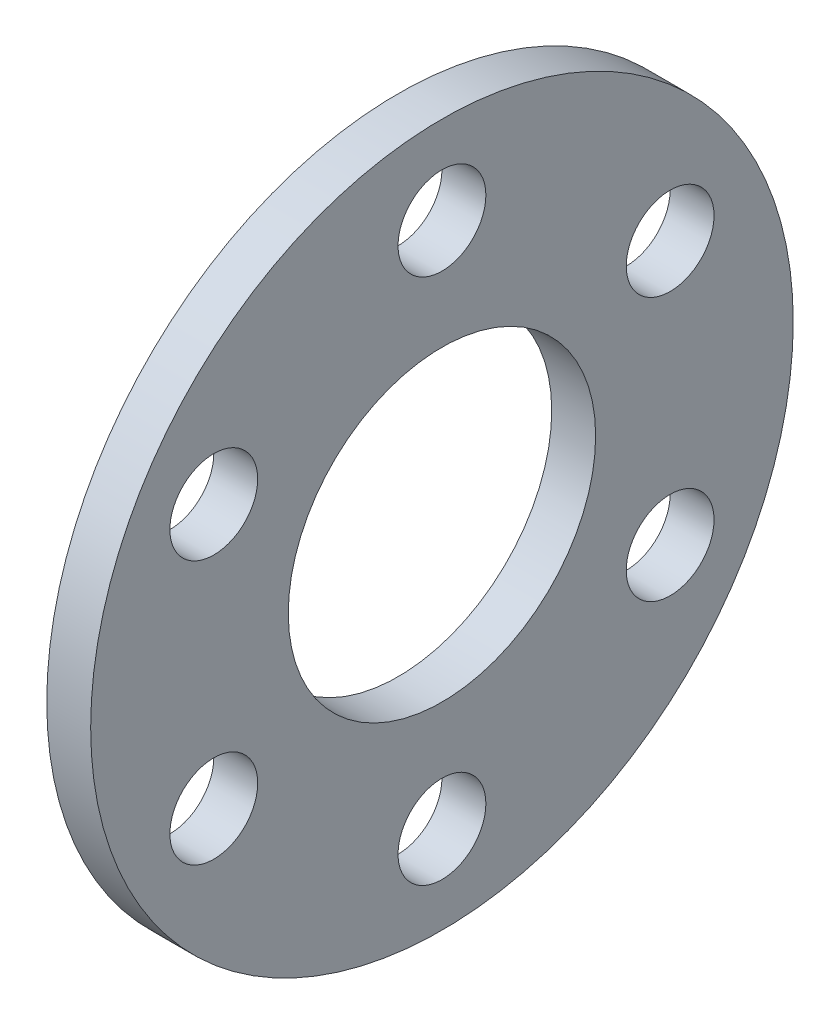
ISO-10303-21;
HEADER;
FILE_DESCRIPTION(('STEP AP214'),'2;1');
FILE_NAME('part.step','',(''),(''),'','','');
FILE_SCHEMA(('AUTOMOTIVE_DESIGN { 1 0 10303 214 1 1 1 1 }'));
ENDSEC;
DATA;
#1=APPLICATION_CONTEXT('core data for automotive mechanical design processes');
#2=APPLICATION_PROTOCOL_DEFINITION('international standard','automotive_design',2000,#1);
#3=PRODUCT_CONTEXT('',#1,'mechanical');
#4=PRODUCT('Part','Part','',(#3));
#5=PRODUCT_RELATED_PRODUCT_CATEGORY('part','',(#4));
#6=PRODUCT_DEFINITION_FORMATION('','',#4);
#7=PRODUCT_DEFINITION_CONTEXT('part definition',#1,'design');
#8=PRODUCT_DEFINITION('design','',#6,#7);
#9=PRODUCT_DEFINITION_SHAPE('','',#8);
#10=(LENGTH_UNIT() NAMED_UNIT(*) SI_UNIT(.MILLI.,.METRE.));
#11=(NAMED_UNIT(*) PLANE_ANGLE_UNIT() SI_UNIT($,.RADIAN.));
#12=(NAMED_UNIT(*) SI_UNIT($,.STERADIAN.) SOLID_ANGLE_UNIT());
#13=UNCERTAINTY_MEASURE_WITH_UNIT(LENGTH_MEASURE(1.E-05),#10,'distance_accuracy_value','');
#14=(GEOMETRIC_REPRESENTATION_CONTEXT(3) GLOBAL_UNCERTAINTY_ASSIGNED_CONTEXT((#13)) GLOBAL_UNIT_ASSIGNED_CONTEXT((#10,
#11,#12)) REPRESENTATION_CONTEXT('',''));
#15=CARTESIAN_POINT('',(0.,0.,0.));
#16=DIRECTION('',(0.,0.,1.));
#17=DIRECTION('',(1.,0.,0.));
#18=AXIS2_PLACEMENT_3D('',#15,#16,#17);
#19=CARTESIAN_POINT('',(3.,0.,0.));
#20=DIRECTION('',(1.,0.,0.));
#21=DIRECTION('',(0.,0.,-1.));
#22=AXIS2_PLACEMENT_3D('',#19,#20,#21);
#23=PLANE('',#22);
#24=CARTESIAN_POINT('',(3.,-17.9999999999996,-8.17298183197627E-13));
#25=DIRECTION('',(1.,0.,0.));
#26=DIRECTION('',(0.,0.,-1.));
#27=AXIS2_PLACEMENT_3D('',#24,#25,#26);
#28=CIRCLE('',#27,3.);
#29=CARTESIAN_POINT('',(3.,-17.9999999999996,-3.00000000000082));
#30=VERTEX_POINT('',#29);
#31=EDGE_CURVE('E72',#30,#30,#28,.T.);
#32=ORIENTED_EDGE('',*,*,#31,.F.);
#33=EDGE_LOOP('',(#32));
#34=FACE_BOUND('',#33,.T.);
#35=CARTESIAN_POINT('',(3.,9.00000000000092,-15.5884572681199));
#36=DIRECTION('',(1.,0.,0.));
#37=DIRECTION('',(0.,0.,-1.));
#38=AXIS2_PLACEMENT_3D('',#35,#36,#37);
#39=CIRCLE('',#38,3.);
#40=CARTESIAN_POINT('',(3.,9.00000000000092,-18.5884572681199));
#41=VERTEX_POINT('',#40);
#42=EDGE_CURVE('E60',#41,#41,#39,.T.);
#43=ORIENTED_EDGE('',*,*,#42,.F.);
#44=EDGE_LOOP('',(#43));
#45=FACE_BOUND('',#44,.T.);
#46=CARTESIAN_POINT('',(3.,8.99999999999996,15.5884572681199));
#47=DIRECTION('',(1.,0.,0.));
#48=DIRECTION('',(0.,0.,-1.));
#49=AXIS2_PLACEMENT_3D('',#46,#47,#48);
#50=CIRCLE('',#49,3.);
#51=CARTESIAN_POINT('',(3.,8.99999999999996,12.5884572681199));
#52=VERTEX_POINT('',#51);
#53=EDGE_CURVE('E48',#52,#52,#50,.T.);
#54=ORIENTED_EDGE('',*,*,#53,.F.);
#55=EDGE_LOOP('',(#54));
#56=FACE_BOUND('',#55,.T.);
#57=CARTESIAN_POINT('',(3.,0.,0.));
#58=DIRECTION('',(1.,0.,0.));
#59=DIRECTION('',(0.,0.,-1.));
#60=AXIS2_PLACEMENT_3D('',#57,#58,#59);
#61=CIRCLE('',#60,24.);
#62=CARTESIAN_POINT('',(3.,0.,-24.));
#63=VERTEX_POINT('',#62);
#64=EDGE_CURVE('E10',#63,#63,#61,.T.);
#65=ORIENTED_EDGE('',*,*,#64,.T.);
#66=EDGE_LOOP('',(#65));
#67=FACE_BOUND('',#66,.T.);
#68=CARTESIAN_POINT('',(3.,0.,0.));
#69=DIRECTION('',(1.,0.,0.));
#70=DIRECTION('',(0.,0.,-1.));
#71=AXIS2_PLACEMENT_3D('',#68,#69,#70);
#72=CIRCLE('',#71,10.5);
#73=CARTESIAN_POINT('',(3.,0.,-10.5));
#74=VERTEX_POINT('',#73);
#75=EDGE_CURVE('E43',#74,#74,#72,.T.);
#76=ORIENTED_EDGE('',*,*,#75,.F.);
#77=EDGE_LOOP('',(#76));
#78=FACE_BOUND('',#77,.T.);
#79=CARTESIAN_POINT('',(3.,18.0000000000004,3.00753131340047E-13));
#80=DIRECTION('',(1.,0.,0.));
#81=DIRECTION('',(0.,0.,-1.));
#82=AXIS2_PLACEMENT_3D('',#79,#80,#81);
#83=CIRCLE('',#82,3.);
#84=CARTESIAN_POINT('',(3.,18.0000000000004,-2.9999999999997));
#85=VERTEX_POINT('',#84);
#86=EDGE_CURVE('E54',#85,#85,#83,.T.);
#87=ORIENTED_EDGE('',*,*,#86,.F.);
#88=EDGE_LOOP('',(#87));
#89=FACE_BOUND('',#88,.T.);
#90=CARTESIAN_POINT('',(3.,-8.99999999999909,-15.5884572681204));
#91=DIRECTION('',(1.,0.,0.));
#92=DIRECTION('',(0.,0.,-1.));
#93=AXIS2_PLACEMENT_3D('',#90,#91,#92);
#94=CIRCLE('',#93,3.);
#95=CARTESIAN_POINT('',(3.,-8.99999999999909,-18.5884572681204));
#96=VERTEX_POINT('',#95);
#97=EDGE_CURVE('E66',#96,#96,#94,.T.);
#98=ORIENTED_EDGE('',*,*,#97,.F.);
#99=EDGE_LOOP('',(#98));
#100=FACE_BOUND('',#99,.T.);
#101=CARTESIAN_POINT('',(3.,-9.00000000000006,15.5884572681194));
#102=DIRECTION('',(1.,0.,0.));
#103=DIRECTION('',(0.,0.,-1.));
#104=AXIS2_PLACEMENT_3D('',#101,#102,#103);
#105=CIRCLE('',#104,3.);
#106=CARTESIAN_POINT('',(3.,-9.00000000000006,12.5884572681194));
#107=VERTEX_POINT('',#106);
#108=EDGE_CURVE('E78',#107,#107,#105,.T.);
#109=ORIENTED_EDGE('',*,*,#108,.F.);
#110=EDGE_LOOP('',(#109));
#111=FACE_BOUND('',#110,.T.);
#112=ADVANCED_FACE('F32',(#34,#45,#56,#67,#78,#89,#100,#111),#23,.T.);
#113=CARTESIAN_POINT('',(0.,0.,0.));
#114=DIRECTION('',(1.,0.,0.));
#115=DIRECTION('',(0.,0.,-1.));
#116=AXIS2_PLACEMENT_3D('',#113,#114,#115);
#117=PLANE('',#116);
#118=CARTESIAN_POINT('',(0.,0.,0.));
#119=DIRECTION('',(1.,0.,0.));
#120=DIRECTION('',(0.,0.,-1.));
#121=AXIS2_PLACEMENT_3D('',#118,#119,#120);
#122=CIRCLE('',#121,24.);
#123=CARTESIAN_POINT('',(0.,0.,-24.));
#124=VERTEX_POINT('',#123);
#125=EDGE_CURVE('E36',#124,#124,#122,.T.);
#126=ORIENTED_EDGE('',*,*,#125,.F.);
#127=EDGE_LOOP('',(#126));
#128=FACE_BOUND('',#127,.T.);
#129=CARTESIAN_POINT('',(0.,0.,0.));
#130=DIRECTION('',(1.,0.,0.));
#131=DIRECTION('',(0.,0.,-1.));
#132=AXIS2_PLACEMENT_3D('',#129,#130,#131);
#133=CIRCLE('',#132,10.5);
#134=CARTESIAN_POINT('',(0.,0.,-10.5));
#135=VERTEX_POINT('',#134);
#136=EDGE_CURVE('E45',#135,#135,#133,.T.);
#137=ORIENTED_EDGE('',*,*,#136,.T.);
#138=EDGE_LOOP('',(#137));
#139=FACE_BOUND('',#138,.T.);
#140=CARTESIAN_POINT('',(0.,8.99999999999996,15.5884572681199));
#141=DIRECTION('',(1.,0.,0.));
#142=DIRECTION('',(0.,0.,-1.));
#143=AXIS2_PLACEMENT_3D('',#140,#141,#142);
#144=CIRCLE('',#143,3.);
#145=CARTESIAN_POINT('',(0.,8.99999999999996,12.5884572681199));
#146=VERTEX_POINT('',#145);
#147=EDGE_CURVE('E51',#146,#146,#144,.T.);
#148=ORIENTED_EDGE('',*,*,#147,.T.);
#149=EDGE_LOOP('',(#148));
#150=FACE_BOUND('',#149,.T.);
#151=CARTESIAN_POINT('',(0.,18.0000000000004,3.00753131340047E-13));
#152=DIRECTION('',(1.,0.,0.));
#153=DIRECTION('',(0.,0.,-1.));
#154=AXIS2_PLACEMENT_3D('',#151,#152,#153);
#155=CIRCLE('',#154,3.);
#156=CARTESIAN_POINT('',(0.,18.0000000000004,-2.9999999999997));
#157=VERTEX_POINT('',#156);
#158=EDGE_CURVE('E57',#157,#157,#155,.T.);
#159=ORIENTED_EDGE('',*,*,#158,.T.);
#160=EDGE_LOOP('',(#159));
#161=FACE_BOUND('',#160,.T.);
#162=CARTESIAN_POINT('',(0.,9.00000000000092,-15.5884572681199));
#163=DIRECTION('',(1.,0.,0.));
#164=DIRECTION('',(0.,0.,-1.));
#165=AXIS2_PLACEMENT_3D('',#162,#163,#164);
#166=CIRCLE('',#165,3.);
#167=CARTESIAN_POINT('',(0.,9.00000000000092,-18.5884572681199));
#168=VERTEX_POINT('',#167);
#169=EDGE_CURVE('E63',#168,#168,#166,.T.);
#170=ORIENTED_EDGE('',*,*,#169,.T.);
#171=EDGE_LOOP('',(#170));
#172=FACE_BOUND('',#171,.T.);
#173=CARTESIAN_POINT('',(0.,-8.99999999999909,-15.5884572681204));
#174=DIRECTION('',(1.,0.,0.));
#175=DIRECTION('',(0.,0.,-1.));
#176=AXIS2_PLACEMENT_3D('',#173,#174,#175);
#177=CIRCLE('',#176,3.);
#178=CARTESIAN_POINT('',(0.,-8.99999999999909,-18.5884572681204));
#179=VERTEX_POINT('',#178);
#180=EDGE_CURVE('E69',#179,#179,#177,.T.);
#181=ORIENTED_EDGE('',*,*,#180,.T.);
#182=EDGE_LOOP('',(#181));
#183=FACE_BOUND('',#182,.T.);
#184=CARTESIAN_POINT('',(0.,-17.9999999999996,-8.17298183197627E-13));
#185=DIRECTION('',(1.,0.,0.));
#186=DIRECTION('',(0.,0.,-1.));
#187=AXIS2_PLACEMENT_3D('',#184,#185,#186);
#188=CIRCLE('',#187,3.);
#189=CARTESIAN_POINT('',(0.,-17.9999999999996,-3.00000000000082));
#190=VERTEX_POINT('',#189);
#191=EDGE_CURVE('E75',#190,#190,#188,.T.);
#192=ORIENTED_EDGE('',*,*,#191,.T.);
#193=EDGE_LOOP('',(#192));
#194=FACE_BOUND('',#193,.T.);
#195=CARTESIAN_POINT('',(0.,-9.00000000000006,15.5884572681194));
#196=DIRECTION('',(1.,0.,0.));
#197=DIRECTION('',(0.,0.,-1.));
#198=AXIS2_PLACEMENT_3D('',#195,#196,#197);
#199=CIRCLE('',#198,3.);
#200=CARTESIAN_POINT('',(0.,-9.00000000000006,12.5884572681194));
#201=VERTEX_POINT('',#200);
#202=EDGE_CURVE('E81',#201,#201,#199,.T.);
#203=ORIENTED_EDGE('',*,*,#202,.T.);
#204=EDGE_LOOP('',(#203));
#205=FACE_BOUND('',#204,.T.);
#206=ADVANCED_FACE('F91',(#128,#139,#150,#161,#172,#183,#194,#205),#117,.F.);
#207=CARTESIAN_POINT('',(3.,0.,0.));
#208=DIRECTION('',(-1.,0.,0.));
#209=DIRECTION('',(0.,0.,1.));
#210=AXIS2_PLACEMENT_3D('',#207,#208,#209);
#211=CYLINDRICAL_SURFACE('',#210,24.);
#212=ORIENTED_EDGE('',*,*,#64,.F.);
#213=EDGE_LOOP('',(#212));
#214=FACE_BOUND('',#213,.T.);
#215=ORIENTED_EDGE('',*,*,#125,.T.);
#216=EDGE_LOOP('',(#215));
#217=FACE_BOUND('',#216,.T.);
#218=ADVANCED_FACE('F34',(#214,#217),#211,.T.);
#219=CARTESIAN_POINT('',(3.,0.,0.));
#220=DIRECTION('',(-1.,0.,0.));
#221=DIRECTION('',(0.,0.,1.));
#222=AXIS2_PLACEMENT_3D('',#219,#220,#221);
#223=CYLINDRICAL_SURFACE('',#222,10.5);
#224=ORIENTED_EDGE('',*,*,#75,.T.);
#225=EDGE_LOOP('',(#224));
#226=FACE_BOUND('',#225,.T.);
#227=ORIENTED_EDGE('',*,*,#136,.F.);
#228=EDGE_LOOP('',(#227));
#229=FACE_BOUND('',#228,.T.);
#230=ADVANCED_FACE('F101',(#226,#229),#223,.F.);
#231=CARTESIAN_POINT('',(3.,8.99999999999996,15.5884572681199));
#232=DIRECTION('',(-1.,0.,0.));
#233=DIRECTION('',(0.,0.,1.));
#234=AXIS2_PLACEMENT_3D('',#231,#232,#233);
#235=CYLINDRICAL_SURFACE('',#234,3.);
#236=ORIENTED_EDGE('',*,*,#53,.T.);
#237=EDGE_LOOP('',(#236));
#238=FACE_BOUND('',#237,.T.);
#239=ORIENTED_EDGE('',*,*,#147,.F.);
#240=EDGE_LOOP('',(#239));
#241=FACE_BOUND('',#240,.T.);
#242=ADVANCED_FACE('F104',(#238,#241),#235,.F.);
#243=CARTESIAN_POINT('',(3.,18.0000000000004,3.00753131340047E-13));
#244=DIRECTION('',(-1.,0.,0.));
#245=DIRECTION('',(0.,0.,1.));
#246=AXIS2_PLACEMENT_3D('',#243,#244,#245);
#247=CYLINDRICAL_SURFACE('',#246,3.);
#248=ORIENTED_EDGE('',*,*,#86,.T.);
#249=EDGE_LOOP('',(#248));
#250=FACE_BOUND('',#249,.T.);
#251=ORIENTED_EDGE('',*,*,#158,.F.);
#252=EDGE_LOOP('',(#251));
#253=FACE_BOUND('',#252,.T.);
#254=ADVANCED_FACE('F108',(#250,#253),#247,.F.);
#255=CARTESIAN_POINT('',(3.,9.00000000000092,-15.5884572681199));
#256=DIRECTION('',(-1.,0.,0.));
#257=DIRECTION('',(0.,0.,1.));
#258=AXIS2_PLACEMENT_3D('',#255,#256,#257);
#259=CYLINDRICAL_SURFACE('',#258,3.);
#260=ORIENTED_EDGE('',*,*,#42,.T.);
#261=EDGE_LOOP('',(#260));
#262=FACE_BOUND('',#261,.T.);
#263=ORIENTED_EDGE('',*,*,#169,.F.);
#264=EDGE_LOOP('',(#263));
#265=FACE_BOUND('',#264,.T.);
#266=ADVANCED_FACE('F112',(#262,#265),#259,.F.);
#267=CARTESIAN_POINT('',(3.,-8.99999999999909,-15.5884572681204));
#268=DIRECTION('',(-1.,0.,0.));
#269=DIRECTION('',(0.,0.,1.));
#270=AXIS2_PLACEMENT_3D('',#267,#268,#269);
#271=CYLINDRICAL_SURFACE('',#270,3.);
#272=ORIENTED_EDGE('',*,*,#97,.T.);
#273=EDGE_LOOP('',(#272));
#274=FACE_BOUND('',#273,.T.);
#275=ORIENTED_EDGE('',*,*,#180,.F.);
#276=EDGE_LOOP('',(#275));
#277=FACE_BOUND('',#276,.T.);
#278=ADVANCED_FACE('F116',(#274,#277),#271,.F.);
#279=CARTESIAN_POINT('',(3.,-17.9999999999996,-8.17298183197627E-13));
#280=DIRECTION('',(-1.,0.,0.));
#281=DIRECTION('',(0.,0.,1.));
#282=AXIS2_PLACEMENT_3D('',#279,#280,#281);
#283=CYLINDRICAL_SURFACE('',#282,3.);
#284=ORIENTED_EDGE('',*,*,#31,.T.);
#285=EDGE_LOOP('',(#284));
#286=FACE_BOUND('',#285,.T.);
#287=ORIENTED_EDGE('',*,*,#191,.F.);
#288=EDGE_LOOP('',(#287));
#289=FACE_BOUND('',#288,.T.);
#290=ADVANCED_FACE('F120',(#286,#289),#283,.F.);
#291=CARTESIAN_POINT('',(3.,-9.00000000000006,15.5884572681194));
#292=DIRECTION('',(-1.,0.,0.));
#293=DIRECTION('',(0.,0.,1.));
#294=AXIS2_PLACEMENT_3D('',#291,#292,#293);
#295=CYLINDRICAL_SURFACE('',#294,3.);
#296=ORIENTED_EDGE('',*,*,#108,.T.);
#297=EDGE_LOOP('',(#296));
#298=FACE_BOUND('',#297,.T.);
#299=ORIENTED_EDGE('',*,*,#202,.F.);
#300=EDGE_LOOP('',(#299));
#301=FACE_BOUND('',#300,.T.);
#302=ADVANCED_FACE('F87',(#298,#301),#295,.F.);
#303=CLOSED_SHELL('',(#112,#206,#218,#230,#242,#254,#266,#278,#290,#302));
#304=MANIFOLD_SOLID_BREP('B2',#303);
#305=ADVANCED_BREP_SHAPE_REPRESENTATION('',(#18,#304),#14);
#306=SHAPE_DEFINITION_REPRESENTATION(#9,#305);
ENDSEC;
END-ISO-10303-21;
